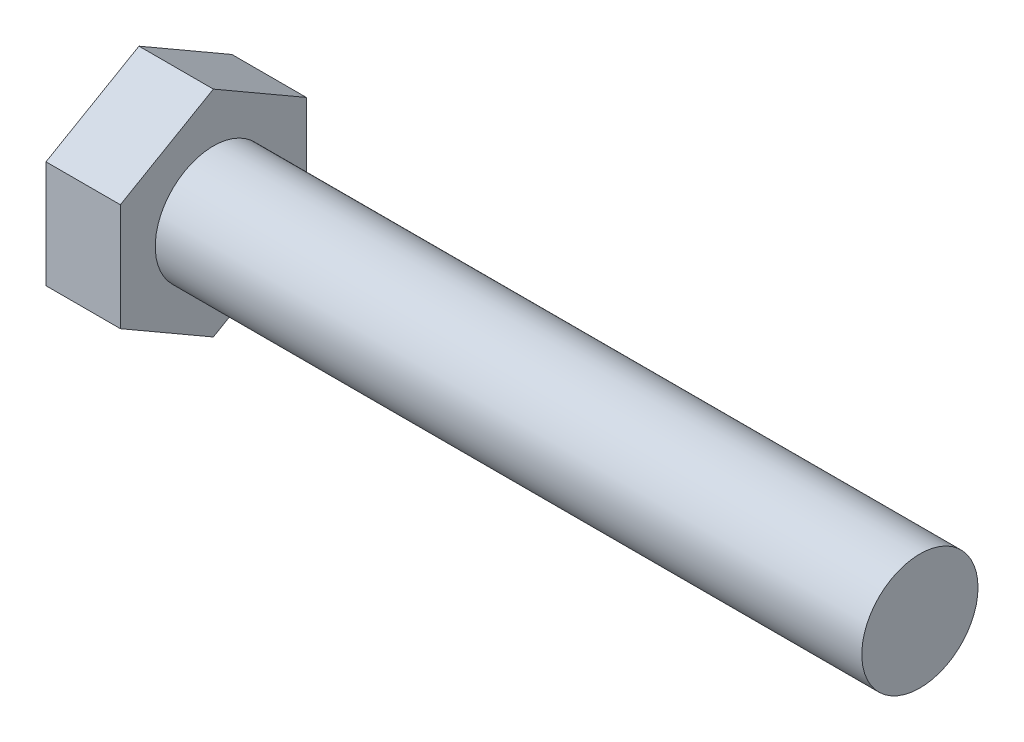
ISO-10303-21;
HEADER;
FILE_DESCRIPTION(('STEP AP214'),'2;1');
FILE_NAME('part.step','',(''),(''),'','','');
FILE_SCHEMA(('AUTOMOTIVE_DESIGN { 1 0 10303 214 1 1 1 1 }'));
ENDSEC;
DATA;
#1=APPLICATION_CONTEXT('core data for automotive mechanical design processes');
#2=APPLICATION_PROTOCOL_DEFINITION('international standard','automotive_design',2000,#1);
#3=PRODUCT_CONTEXT('',#1,'mechanical');
#4=PRODUCT('Part','Part','',(#3));
#5=PRODUCT_RELATED_PRODUCT_CATEGORY('part','',(#4));
#6=PRODUCT_DEFINITION_FORMATION('','',#4);
#7=PRODUCT_DEFINITION_CONTEXT('part definition',#1,'design');
#8=PRODUCT_DEFINITION('design','',#6,#7);
#9=PRODUCT_DEFINITION_SHAPE('','',#8);
#10=(LENGTH_UNIT() NAMED_UNIT(*) SI_UNIT(.MILLI.,.METRE.));
#11=(NAMED_UNIT(*) PLANE_ANGLE_UNIT() SI_UNIT($,.RADIAN.));
#12=(NAMED_UNIT(*) SI_UNIT($,.STERADIAN.) SOLID_ANGLE_UNIT());
#13=UNCERTAINTY_MEASURE_WITH_UNIT(LENGTH_MEASURE(1.E-05),#10,'distance_accuracy_value','');
#14=(GEOMETRIC_REPRESENTATION_CONTEXT(3) GLOBAL_UNCERTAINTY_ASSIGNED_CONTEXT((#13)) GLOBAL_UNIT_ASSIGNED_CONTEXT((#10,
#11,#12)) REPRESENTATION_CONTEXT('',''));
#15=CARTESIAN_POINT('',(0.,0.,0.));
#16=DIRECTION('',(0.,0.,1.));
#17=DIRECTION('',(1.,0.,0.));
#18=AXIS2_PLACEMENT_3D('',#15,#16,#17);
#19=CARTESIAN_POINT('',(5.08,-3.66617420935401,-6.35));
#20=DIRECTION('',(0.,0.,1.));
#21=DIRECTION('',(0.,-1.,0.));
#22=AXIS2_PLACEMENT_3D('',#19,#20,#21);
#23=PLANE('',#22);
#24=DIRECTION('',(0.,1.,0.));
#25=VECTOR('',#24,1.);
#26=CARTESIAN_POINT('',(0.,-3.66617420935401,-6.35));
#27=LINE('',#26,#25);
#28=CARTESIAN_POINT('',(0.,-3.66617420935401,-6.35));
#29=VERTEX_POINT('',#28);
#30=CARTESIAN_POINT('',(0.,3.66617420935424,-6.35));
#31=VERTEX_POINT('',#30);
#32=EDGE_CURVE('E117',#29,#31,#27,.T.);
#33=ORIENTED_EDGE('',*,*,#32,.T.);
#34=DIRECTION('',(-1.,0.,0.));
#35=VECTOR('',#34,1.);
#36=CARTESIAN_POINT('',(5.08,3.66617420935424,-6.35));
#37=LINE('',#36,#35);
#38=CARTESIAN_POINT('',(5.08,3.66617420935424,-6.35));
#39=VERTEX_POINT('',#38);
#40=EDGE_CURVE('E11',#39,#31,#37,.T.);
#41=ORIENTED_EDGE('',*,*,#40,.F.);
#42=DIRECTION('',(0.,1.,0.));
#43=VECTOR('',#42,1.);
#44=CARTESIAN_POINT('',(5.08,-3.66617420935401,-6.35));
#45=LINE('',#44,#43);
#46=CARTESIAN_POINT('',(5.08,-3.66617420935401,-6.35));
#47=VERTEX_POINT('',#46);
#48=EDGE_CURVE('E128',#47,#39,#45,.T.);
#49=ORIENTED_EDGE('',*,*,#48,.F.);
#50=DIRECTION('',(-1.,0.,0.));
#51=VECTOR('',#50,1.);
#52=CARTESIAN_POINT('',(5.08,-3.66617420935401,-6.35));
#53=LINE('',#52,#51);
#54=EDGE_CURVE('E113',#47,#29,#53,.T.);
#55=ORIENTED_EDGE('',*,*,#54,.T.);
#56=EDGE_LOOP('',(#33,#41,#49,#55));
#57=FACE_BOUND('',#56,.T.);
#58=ADVANCED_FACE('F33',(#57),#23,.F.);
#59=CARTESIAN_POINT('',(5.08,3.66617420935424,-6.35));
#60=DIRECTION('',(0.,-0.866025403784439,0.5));
#61=DIRECTION('',(0.,-0.5,-0.866025403784439));
#62=AXIS2_PLACEMENT_3D('',#59,#60,#61);
#63=PLANE('',#62);
#64=DIRECTION('',(0.,0.5,0.866025403784439));
#65=VECTOR('',#64,1.);
#66=CARTESIAN_POINT('',(0.,3.66617420935424,-6.35));
#67=LINE('',#66,#65);
#68=CARTESIAN_POINT('',(0.,7.33234841870836,0.));
#69=VERTEX_POINT('',#68);
#70=EDGE_CURVE('E120',#31,#69,#67,.T.);
#71=ORIENTED_EDGE('',*,*,#70,.T.);
#72=DIRECTION('',(-1.,0.,0.));
#73=VECTOR('',#72,1.);
#74=CARTESIAN_POINT('',(5.08,7.33234841870836,0.));
#75=LINE('',#74,#73);
#76=CARTESIAN_POINT('',(5.08,7.33234841870836,0.));
#77=VERTEX_POINT('',#76);
#78=EDGE_CURVE('E41',#77,#69,#75,.T.);
#79=ORIENTED_EDGE('',*,*,#78,.F.);
#80=DIRECTION('',(0.,0.5,0.866025403784439));
#81=VECTOR('',#80,1.);
#82=CARTESIAN_POINT('',(5.08,3.66617420935424,-6.35));
#83=LINE('',#82,#81);
#84=EDGE_CURVE('E86',#39,#77,#83,.T.);
#85=ORIENTED_EDGE('',*,*,#84,.F.);
#86=ORIENTED_EDGE('',*,*,#40,.T.);
#87=EDGE_LOOP('',(#71,#79,#85,#86));
#88=FACE_BOUND('',#87,.T.);
#89=ADVANCED_FACE('F153',(#88),#63,.F.);
#90=CARTESIAN_POINT('',(5.08,7.33234841870836,0.));
#91=DIRECTION('',(0.,-0.866025403784439,-0.5));
#92=DIRECTION('',(0.,0.5,-0.866025403784439));
#93=AXIS2_PLACEMENT_3D('',#90,#91,#92);
#94=PLANE('',#93);
#95=DIRECTION('',(0.,-0.5,0.866025403784439));
#96=VECTOR('',#95,1.);
#97=CARTESIAN_POINT('',(0.,7.33234841870836,0.));
#98=LINE('',#97,#96);
#99=CARTESIAN_POINT('',(0.,3.66617420935424,6.35));
#100=VERTEX_POINT('',#99);
#101=EDGE_CURVE('E123',#69,#100,#98,.T.);
#102=ORIENTED_EDGE('',*,*,#101,.T.);
#103=DIRECTION('',(-1.,0.,0.));
#104=VECTOR('',#103,1.);
#105=CARTESIAN_POINT('',(5.08,3.66617420935424,6.35));
#106=LINE('',#105,#104);
#107=CARTESIAN_POINT('',(5.08,3.66617420935424,6.35));
#108=VERTEX_POINT('',#107);
#109=EDGE_CURVE('E108',#108,#100,#106,.T.);
#110=ORIENTED_EDGE('',*,*,#109,.F.);
#111=DIRECTION('',(0.,-0.5,0.866025403784439));
#112=VECTOR('',#111,1.);
#113=CARTESIAN_POINT('',(5.08,7.33234841870836,0.));
#114=LINE('',#113,#112);
#115=EDGE_CURVE('E99',#77,#108,#114,.T.);
#116=ORIENTED_EDGE('',*,*,#115,.F.);
#117=ORIENTED_EDGE('',*,*,#78,.T.);
#118=EDGE_LOOP('',(#102,#110,#116,#117));
#119=FACE_BOUND('',#118,.T.);
#120=ADVANCED_FACE('F134',(#119),#94,.F.);
#121=CARTESIAN_POINT('',(5.08,3.66617420935424,6.35));
#122=DIRECTION('',(0.,0.,-1.));
#123=DIRECTION('',(-1.,0.,0.));
#124=AXIS2_PLACEMENT_3D('',#121,#122,#123);
#125=PLANE('',#124);
#126=DIRECTION('',(0.,-1.,0.));
#127=VECTOR('',#126,1.);
#128=CARTESIAN_POINT('',(0.,3.66617420935424,6.35));
#129=LINE('',#128,#127);
#130=CARTESIAN_POINT('',(0.,-3.66617420935401,6.35));
#131=VERTEX_POINT('',#130);
#132=EDGE_CURVE('E107',#100,#131,#129,.T.);
#133=ORIENTED_EDGE('',*,*,#132,.T.);
#134=DIRECTION('',(-1.,0.,0.));
#135=VECTOR('',#134,1.);
#136=CARTESIAN_POINT('',(5.08,-3.66617420935401,6.35));
#137=LINE('',#136,#135);
#138=CARTESIAN_POINT('',(5.08,-3.66617420935401,6.35));
#139=VERTEX_POINT('',#138);
#140=EDGE_CURVE('E104',#139,#131,#137,.T.);
#141=ORIENTED_EDGE('',*,*,#140,.F.);
#142=DIRECTION('',(0.,-1.,0.));
#143=VECTOR('',#142,1.);
#144=CARTESIAN_POINT('',(5.08,3.66617420935424,6.35));
#145=LINE('',#144,#143);
#146=EDGE_CURVE('E93',#108,#139,#145,.T.);
#147=ORIENTED_EDGE('',*,*,#146,.F.);
#148=ORIENTED_EDGE('',*,*,#109,.T.);
#149=EDGE_LOOP('',(#133,#141,#147,#148));
#150=FACE_BOUND('',#149,.T.);
#151=ADVANCED_FACE('F105',(#150),#125,.F.);
#152=CARTESIAN_POINT('',(5.08,-3.66617420935401,6.35));
#153=DIRECTION('',(0.,0.866025403784438,-0.5));
#154=DIRECTION('',(0.,0.5,0.866025403784439));
#155=AXIS2_PLACEMENT_3D('',#152,#153,#154);
#156=PLANE('',#155);
#157=DIRECTION('',(0.,-0.5,-0.866025403784439));
#158=VECTOR('',#157,1.);
#159=CARTESIAN_POINT('',(0.,-3.66617420935401,6.35));
#160=LINE('',#159,#158);
#161=CARTESIAN_POINT('',(0.,-7.33234841870813,0.));
#162=VERTEX_POINT('',#161);
#163=EDGE_CURVE('E72',#131,#162,#160,.T.);
#164=ORIENTED_EDGE('',*,*,#163,.T.);
#165=DIRECTION('',(-1.,0.,0.));
#166=VECTOR('',#165,1.);
#167=CARTESIAN_POINT('',(5.08,-7.33234841870813,0.));
#168=LINE('',#167,#166);
#169=CARTESIAN_POINT('',(5.08,-7.33234841870813,0.));
#170=VERTEX_POINT('',#169);
#171=EDGE_CURVE('E109',#170,#162,#168,.T.);
#172=ORIENTED_EDGE('',*,*,#171,.F.);
#173=DIRECTION('',(0.,-0.5,-0.866025403784439));
#174=VECTOR('',#173,1.);
#175=CARTESIAN_POINT('',(5.08,-3.66617420935401,6.35));
#176=LINE('',#175,#174);
#177=EDGE_CURVE('E97',#139,#170,#176,.T.);
#178=ORIENTED_EDGE('',*,*,#177,.F.);
#179=ORIENTED_EDGE('',*,*,#140,.T.);
#180=EDGE_LOOP('',(#164,#172,#178,#179));
#181=FACE_BOUND('',#180,.T.);
#182=ADVANCED_FACE('F111',(#181),#156,.F.);
#183=CARTESIAN_POINT('',(5.08,-7.33234841870813,0.));
#184=DIRECTION('',(0.,0.866025403784438,0.5));
#185=DIRECTION('',(0.,-0.5,0.866025403784438));
#186=AXIS2_PLACEMENT_3D('',#183,#184,#185);
#187=PLANE('',#186);
#188=DIRECTION('',(0.,0.5,-0.866025403784438));
#189=VECTOR('',#188,1.);
#190=CARTESIAN_POINT('',(0.,-7.33234841870813,0.));
#191=LINE('',#190,#189);
#192=EDGE_CURVE('E78',#162,#29,#191,.T.);
#193=ORIENTED_EDGE('',*,*,#192,.T.);
#194=ORIENTED_EDGE('',*,*,#54,.F.);
#195=DIRECTION('',(0.,0.5,-0.866025403784438));
#196=VECTOR('',#195,1.);
#197=CARTESIAN_POINT('',(5.08,-7.33234841870813,0.));
#198=LINE('',#197,#196);
#199=EDGE_CURVE('E49',#170,#47,#198,.T.);
#200=ORIENTED_EDGE('',*,*,#199,.F.);
#201=ORIENTED_EDGE('',*,*,#171,.T.);
#202=EDGE_LOOP('',(#193,#194,#200,#201));
#203=FACE_BOUND('',#202,.T.);
#204=ADVANCED_FACE('F141',(#203),#187,.F.);
#205=CARTESIAN_POINT('',(5.08,0.,0.));
#206=DIRECTION('',(1.,0.,0.));
#207=DIRECTION('',(0.,0.,-1.));
#208=AXIS2_PLACEMENT_3D('',#205,#206,#207);
#209=PLANE('',#208);
#210=CARTESIAN_POINT('',(5.08,0.,0.));
#211=DIRECTION('',(1.,0.,0.));
#212=DIRECTION('',(0.,0.,-1.));
#213=AXIS2_PLACEMENT_3D('',#210,#211,#212);
#214=CIRCLE('',#213,3.96875);
#215=CARTESIAN_POINT('',(5.08,0.,-3.96875));
#216=VERTEX_POINT('',#215);
#217=EDGE_CURVE('E214',#216,#216,#214,.T.);
#218=ORIENTED_EDGE('',*,*,#217,.F.);
#219=EDGE_LOOP('',(#218));
#220=FACE_BOUND('',#219,.T.);
#221=ORIENTED_EDGE('',*,*,#48,.T.);
#222=ORIENTED_EDGE('',*,*,#84,.T.);
#223=ORIENTED_EDGE('',*,*,#115,.T.);
#224=ORIENTED_EDGE('',*,*,#146,.T.);
#225=ORIENTED_EDGE('',*,*,#177,.T.);
#226=ORIENTED_EDGE('',*,*,#199,.T.);
#227=EDGE_LOOP('',(#221,#222,#223,#224,#225,#226));
#228=FACE_BOUND('',#227,.T.);
#229=ADVANCED_FACE('F95',(#220,#228),#209,.T.);
#230=CARTESIAN_POINT('',(0.,0.,0.));
#231=DIRECTION('',(1.,0.,0.));
#232=DIRECTION('',(0.,0.,-1.));
#233=AXIS2_PLACEMENT_3D('',#230,#231,#232);
#234=PLANE('',#233);
#235=ORIENTED_EDGE('',*,*,#32,.F.);
#236=ORIENTED_EDGE('',*,*,#192,.F.);
#237=ORIENTED_EDGE('',*,*,#163,.F.);
#238=ORIENTED_EDGE('',*,*,#132,.F.);
#239=ORIENTED_EDGE('',*,*,#101,.F.);
#240=ORIENTED_EDGE('',*,*,#70,.F.);
#241=EDGE_LOOP('',(#235,#236,#237,#238,#239,#240));
#242=FACE_BOUND('',#241,.T.);
#243=ADVANCED_FACE('F137',(#242),#234,.F.);
#244=CARTESIAN_POINT('',(53.34,0.,0.));
#245=DIRECTION('',(-1.,0.,0.));
#246=DIRECTION('',(0.,0.,1.));
#247=AXIS2_PLACEMENT_3D('',#244,#245,#246);
#248=CYLINDRICAL_SURFACE('',#247,3.96875);
#249=CARTESIAN_POINT('',(53.34,0.,0.));
#250=DIRECTION('',(1.,0.,0.));
#251=DIRECTION('',(0.,0.,-1.));
#252=AXIS2_PLACEMENT_3D('',#249,#250,#251);
#253=CIRCLE('',#252,3.96875);
#254=CARTESIAN_POINT('',(53.34,0.,-3.96875));
#255=VERTEX_POINT('',#254);
#256=EDGE_CURVE('E121',#255,#255,#253,.T.);
#257=ORIENTED_EDGE('',*,*,#256,.F.);
#258=EDGE_LOOP('',(#257));
#259=FACE_BOUND('',#258,.T.);
#260=ORIENTED_EDGE('',*,*,#217,.T.);
#261=EDGE_LOOP('',(#260));
#262=FACE_BOUND('',#261,.T.);
#263=ADVANCED_FACE('F185',(#259,#262),#248,.T.);
#264=CARTESIAN_POINT('',(53.34,0.,0.));
#265=DIRECTION('',(1.,0.,0.));
#266=DIRECTION('',(0.,0.,-1.));
#267=AXIS2_PLACEMENT_3D('',#264,#265,#266);
#268=PLANE('',#267);
#269=ORIENTED_EDGE('',*,*,#256,.T.);
#270=EDGE_LOOP('',(#269));
#271=FACE_BOUND('',#270,.T.);
#272=ADVANCED_FACE('F198',(#271),#268,.T.);
#273=CLOSED_SHELL('',(#58,#89,#120,#151,#182,#204,#229,#243,#263,#272));
#274=MANIFOLD_SOLID_BREP('B2',#273);
#275=ADVANCED_BREP_SHAPE_REPRESENTATION('',(#18,#274),#14);
#276=SHAPE_DEFINITION_REPRESENTATION(#9,#275);
ENDSEC;
END-ISO-10303-21;
